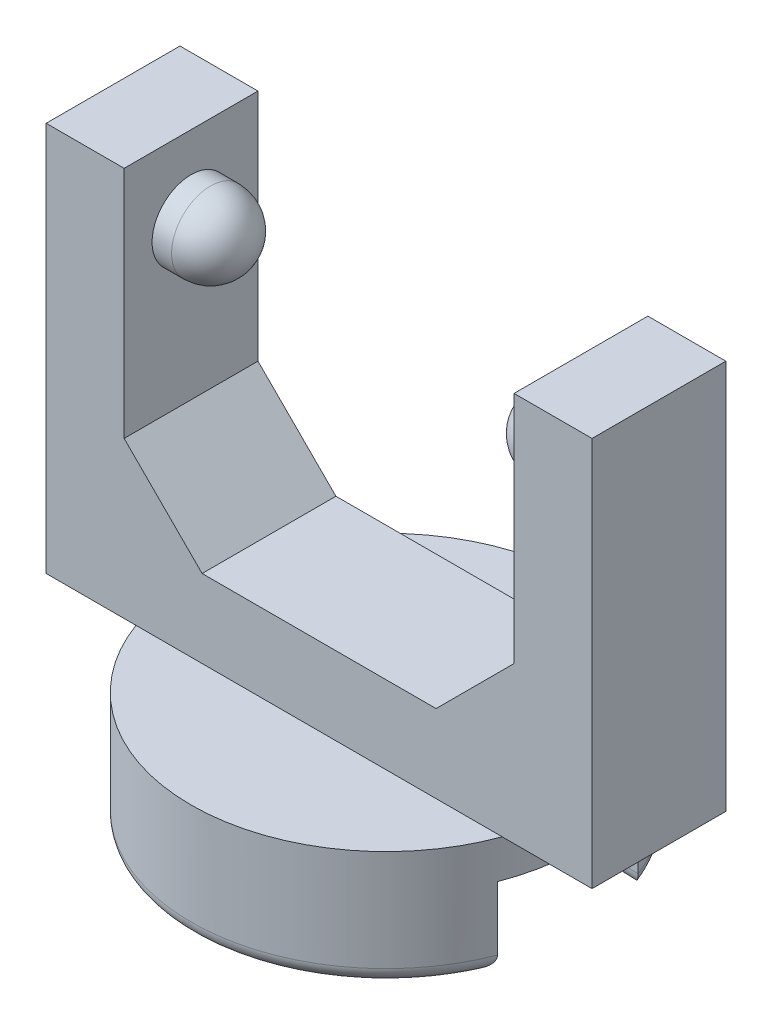
ISO-10303-21;
HEADER;
FILE_DESCRIPTION(('STEP AP214'),'2;1');
FILE_NAME('part.step','',(''),(''),'','','');
FILE_SCHEMA(('AUTOMOTIVE_DESIGN { 1 0 10303 214 1 1 1 1 }'));
ENDSEC;
DATA;
#1=APPLICATION_CONTEXT('core data for automotive mechanical design processes');
#2=APPLICATION_PROTOCOL_DEFINITION('international standard','automotive_design',2000,#1);
#3=PRODUCT_CONTEXT('',#1,'mechanical');
#4=PRODUCT('Part','Part','',(#3));
#5=PRODUCT_RELATED_PRODUCT_CATEGORY('part','',(#4));
#6=PRODUCT_DEFINITION_FORMATION('','',#4);
#7=PRODUCT_DEFINITION_CONTEXT('part definition',#1,'design');
#8=PRODUCT_DEFINITION('design','',#6,#7);
#9=PRODUCT_DEFINITION_SHAPE('','',#8);
#10=(LENGTH_UNIT() NAMED_UNIT(*) SI_UNIT(.MILLI.,.METRE.));
#11=(NAMED_UNIT(*) PLANE_ANGLE_UNIT() SI_UNIT($,.RADIAN.));
#12=(NAMED_UNIT(*) SI_UNIT($,.STERADIAN.) SOLID_ANGLE_UNIT());
#13=UNCERTAINTY_MEASURE_WITH_UNIT(LENGTH_MEASURE(1.E-05),#10,'distance_accuracy_value','');
#14=(GEOMETRIC_REPRESENTATION_CONTEXT(3) GLOBAL_UNCERTAINTY_ASSIGNED_CONTEXT((#13)) GLOBAL_UNIT_ASSIGNED_CONTEXT((#10,
#11,#12)) REPRESENTATION_CONTEXT('',''));
#15=CARTESIAN_POINT('',(0.,0.,0.));
#16=DIRECTION('',(0.,0.,1.));
#17=DIRECTION('',(1.,0.,0.));
#18=AXIS2_PLACEMENT_3D('',#15,#16,#17);
#19=CARTESIAN_POINT('',(0.,7.5,0.));
#20=DIRECTION('',(0.,-1.,0.));
#21=DIRECTION('',(0.,0.,-1.));
#22=AXIS2_PLACEMENT_3D('',#19,#20,#21);
#23=CYLINDRICAL_SURFACE('',#22,12.5);
#24=CARTESIAN_POINT('',(0.,7.5,0.));
#25=DIRECTION('',(0.,1.,0.));
#26=DIRECTION('',(0.,0.,1.));
#27=AXIS2_PLACEMENT_3D('',#24,#25,#26);
#28=CIRCLE('',#27,12.5);
#29=CARTESIAN_POINT('',(11.7406390583043,7.5,4.29038395748194));
#30=VERTEX_POINT('',#29);
#31=CARTESIAN_POINT('',(11.7406390583044,7.5,-4.29038395748194));
#32=VERTEX_POINT('',#31);
#33=EDGE_CURVE('E353',#30,#32,#28,.T.);
#34=ORIENTED_EDGE('',*,*,#33,.F.);
#35=CARTESIAN_POINT('',(-11.7406390583044,7.5,4.29038395748193));
#36=VERTEX_POINT('',#35);
#37=EDGE_CURVE('E352',#36,#30,#28,.T.);
#38=ORIENTED_EDGE('',*,*,#37,.F.);
#39=CARTESIAN_POINT('',(-11.7406390583044,7.5,-4.29038395748194));
#40=VERTEX_POINT('',#39);
#41=EDGE_CURVE('E653',#40,#36,#28,.T.);
#42=ORIENTED_EDGE('',*,*,#41,.F.);
#43=EDGE_CURVE('E357',#32,#40,#28,.T.);
#44=ORIENTED_EDGE('',*,*,#43,.F.);
#45=EDGE_LOOP('',(#34,#38,#42,#44));
#46=FACE_BOUND('',#45,.T.);
#47=DIRECTION('',(0.,-1.,0.));
#48=VECTOR('',#47,1.);
#49=CARTESIAN_POINT('',(11.6578277529164,5.08,-4.51054897804388));
#50=LINE('',#49,#48);
#51=CARTESIAN_POINT('',(11.6578277529164,5.08,-4.51054897804388));
#52=VERTEX_POINT('',#51);
#53=CARTESIAN_POINT('',(11.6578277529164,1.,-4.51054897804388));
#54=VERTEX_POINT('',#53);
#55=EDGE_CURVE('E254',#52,#54,#50,.T.);
#56=ORIENTED_EDGE('',*,*,#55,.T.);
#57=CARTESIAN_POINT('',(0.,1.,0.));
#58=DIRECTION('',(0.,1.,0.));
#59=DIRECTION('',(0.,0.,1.));
#60=AXIS2_PLACEMENT_3D('',#57,#58,#59);
#61=CIRCLE('',#60,12.5);
#62=CARTESIAN_POINT('',(11.6578277529163,1.,4.510548978044));
#63=VERTEX_POINT('',#62);
#64=EDGE_CURVE('E48',#54,#63,#61,.T.);
#65=ORIENTED_EDGE('',*,*,#64,.T.);
#66=DIRECTION('',(0.,-1.,0.));
#67=VECTOR('',#66,1.);
#68=CARTESIAN_POINT('',(11.6578277529163,5.08,4.510548978044));
#69=LINE('',#68,#67);
#70=CARTESIAN_POINT('',(11.6578277529163,5.08,4.510548978044));
#71=VERTEX_POINT('',#70);
#72=EDGE_CURVE('E250',#71,#63,#69,.T.);
#73=ORIENTED_EDGE('',*,*,#72,.F.);
#74=CARTESIAN_POINT('',(0.,5.08,0.));
#75=DIRECTION('',(0.,-1.,0.));
#76=DIRECTION('',(0.,0.,-1.));
#77=AXIS2_PLACEMENT_3D('',#74,#75,#76);
#78=CIRCLE('',#77,12.5);
#79=EDGE_CURVE('E223',#52,#71,#78,.T.);
#80=ORIENTED_EDGE('',*,*,#79,.F.);
#81=EDGE_LOOP('',(#56,#65,#73,#80));
#82=FACE_BOUND('',#81,.T.);
#83=ADVANCED_FACE('F38',(#46,#82),#23,.T.);
#84=CARTESIAN_POINT('',(0.,0.,0.));
#85=DIRECTION('',(0.,1.,0.));
#86=DIRECTION('',(0.,0.,1.));
#87=AXIS2_PLACEMENT_3D('',#84,#85,#86);
#88=PLANE('',#87);
#89=DIRECTION('',(0.866025403784439,0.,0.5));
#90=VECTOR('',#89,1.);
#91=CARTESIAN_POINT('',(-0.686525244046594,0.,9.95929214352111));
#92=LINE('',#91,#90);
#93=CARTESIAN_POINT('',(-9.12402524404657,0.,5.08789924723365));
#94=VERTEX_POINT('',#93);
#95=CARTESIAN_POINT('',(-0.186525244046594,0.,10.2479672781159));
#96=VERTEX_POINT('',#95);
#97=EDGE_CURVE('E419',#94,#96,#92,.T.);
#98=ORIENTED_EDGE('',*,*,#97,.T.);
#99=DIRECTION('',(0.866025403784439,0.,-0.5));
#100=VECTOR('',#99,1.);
#101=CARTESIAN_POINT('',(8.25097475595342,0.,5.37657438182844));
#102=LINE('',#101,#100);
#103=CARTESIAN_POINT('',(8.01892394838455,0.,5.510548978044));
#104=VERTEX_POINT('',#103);
#105=EDGE_CURVE('E422',#96,#104,#102,.T.);
#106=ORIENTED_EDGE('',*,*,#105,.T.);
#107=DIRECTION('',(1.,0.,0.));
#108=VECTOR('',#107,1.);
#109=CARTESIAN_POINT('',(11.6578277529163,0.,5.510548978044));
#110=LINE('',#109,#108);
#111=CARTESIAN_POINT('',(10.0937530166226,0.,5.510548978044));
#112=VERTEX_POINT('',#111);
#113=EDGE_CURVE('E401',#104,#112,#110,.T.);
#114=ORIENTED_EDGE('',*,*,#113,.T.);
#115=CARTESIAN_POINT('',(0.,0.,0.));
#116=DIRECTION('',(0.,1.,0.));
#117=DIRECTION('',(0.,0.,1.));
#118=AXIS2_PLACEMENT_3D('',#115,#116,#117);
#119=CIRCLE('',#118,11.5);
#120=CARTESIAN_POINT('',(10.0609424852993,0.,-5.57022767106509));
#121=VERTEX_POINT('',#120);
#122=EDGE_CURVE('E404',#112,#121,#119,.F.);
#123=ORIENTED_EDGE('',*,*,#122,.T.);
#124=DIRECTION('',(-0.999318241872767,0.,-0.036919526816074));
#125=VECTOR('',#124,1.);
#126=CARTESIAN_POINT('',(7.7878942827695,0.,-5.65420478721405));
#127=LINE('',#126,#125);
#128=CARTESIAN_POINT('',(8.03597981134498,0.,-5.64503933826982));
#129=VERTEX_POINT('',#128);
#130=EDGE_CURVE('E407',#121,#129,#127,.T.);
#131=ORIENTED_EDGE('',*,*,#130,.T.);
#132=DIRECTION('',(-0.866025403784439,0.,-0.5));
#133=VECTOR('',#132,1.);
#134=CARTESIAN_POINT('',(0.313474755953443,0.,-10.1036297108184));
#135=LINE('',#134,#133);
#136=CARTESIAN_POINT('',(-0.186525244046554,0.,-10.3923048454132));
#137=VERTEX_POINT('',#136);
#138=EDGE_CURVE('E410',#129,#137,#135,.T.);
#139=ORIENTED_EDGE('',*,*,#138,.T.);
#140=DIRECTION('',(-0.866025403784439,0.,0.5));
#141=VECTOR('',#140,1.);
#142=CARTESIAN_POINT('',(-8.62402524404657,0.,-5.52091194912571));
#143=LINE('',#142,#141);
#144=CARTESIAN_POINT('',(-9.12402524404657,0.,-5.23223681453089));
#145=VERTEX_POINT('',#144);
#146=EDGE_CURVE('E413',#137,#145,#143,.T.);
#147=ORIENTED_EDGE('',*,*,#146,.T.);
#148=DIRECTION('',(0.,0.,1.));
#149=VECTOR('',#148,1.);
#150=CARTESIAN_POINT('',(-9.12402524404657,0.,4.51054897804403));
#151=LINE('',#150,#149);
#152=EDGE_CURVE('E416',#145,#94,#151,.T.);
#153=ORIENTED_EDGE('',*,*,#152,.T.);
#154=EDGE_LOOP('',(#98,#106,#114,#123,#131,#139,#147,#153));
#155=FACE_BOUND('',#154,.T.);
#156=ADVANCED_FACE('F499',(#155),#88,.F.);
#157=CARTESIAN_POINT('',(0.,32.5,0.));
#158=DIRECTION('',(0.,1.,0.));
#159=DIRECTION('',(0.,0.,1.));
#160=AXIS2_PLACEMENT_3D('',#157,#158,#159);
#161=PLANE('',#160);
#162=DIRECTION('',(0.,0.,1.));
#163=VECTOR('',#162,1.);
#164=CARTESIAN_POINT('',(-12.5,32.5,-4.29038395748194));
#165=LINE('',#164,#163);
#166=CARTESIAN_POINT('',(-12.5,32.5,-4.29038395748194));
#167=VERTEX_POINT('',#166);
#168=CARTESIAN_POINT('',(-12.5,32.5,4.29038395748193));
#169=VERTEX_POINT('',#168);
#170=EDGE_CURVE('E253',#167,#169,#165,.T.);
#171=ORIENTED_EDGE('',*,*,#170,.F.);
#172=DIRECTION('',(-1.,0.,0.));
#173=VECTOR('',#172,1.);
#174=CARTESIAN_POINT('',(-17.5,32.5,-4.29038395748194));
#175=LINE('',#174,#173);
#176=CARTESIAN_POINT('',(-17.5,32.5,-4.29038395748194));
#177=VERTEX_POINT('',#176);
#178=EDGE_CURVE('E314',#167,#177,#175,.T.);
#179=ORIENTED_EDGE('',*,*,#178,.T.);
#180=DIRECTION('',(0.,0.,1.));
#181=VECTOR('',#180,1.);
#182=CARTESIAN_POINT('',(-17.5,32.5,-4.29038395748194));
#183=LINE('',#182,#181);
#184=CARTESIAN_POINT('',(-17.5,32.5,4.29038395748193));
#185=VERTEX_POINT('',#184);
#186=EDGE_CURVE('E301',#177,#185,#183,.T.);
#187=ORIENTED_EDGE('',*,*,#186,.T.);
#188=DIRECTION('',(1.,0.,0.));
#189=VECTOR('',#188,1.);
#190=CARTESIAN_POINT('',(-17.5,32.5,4.29038395748193));
#191=LINE('',#190,#189);
#192=EDGE_CURVE('E307',#185,#169,#191,.T.);
#193=ORIENTED_EDGE('',*,*,#192,.T.);
#194=EDGE_LOOP('',(#171,#179,#187,#193));
#195=FACE_BOUND('',#194,.T.);
#196=ADVANCED_FACE('F506',(#195),#161,.T.);
#197=CARTESIAN_POINT('',(0.,7.5,0.));
#198=DIRECTION('',(0.,1.,0.));
#199=DIRECTION('',(0.,0.,1.));
#200=AXIS2_PLACEMENT_3D('',#197,#198,#199);
#201=PLANE('',#200);
#202=DIRECTION('',(-1.,0.,0.));
#203=VECTOR('',#202,1.);
#204=CARTESIAN_POINT('',(-17.5,7.5,-4.29038395748194));
#205=LINE('',#204,#203);
#206=EDGE_CURVE('E336',#32,#40,#205,.T.);
#207=ORIENTED_EDGE('',*,*,#206,.F.);
#208=ORIENTED_EDGE('',*,*,#43,.T.);
#209=EDGE_LOOP('',(#207,#208));
#210=FACE_BOUND('',#209,.T.);
#211=ADVANCED_FACE('F640',(#210),#201,.T.);
#212=DIRECTION('',(1.,0.,0.));
#213=VECTOR('',#212,1.);
#214=CARTESIAN_POINT('',(-17.5,7.5,4.29038395748193));
#215=LINE('',#214,#213);
#216=EDGE_CURVE('E329',#36,#30,#215,.T.);
#217=ORIENTED_EDGE('',*,*,#216,.F.);
#218=ORIENTED_EDGE('',*,*,#37,.T.);
#219=EDGE_LOOP('',(#217,#218));
#220=FACE_BOUND('',#219,.T.);
#221=ADVANCED_FACE('F623',(#220),#201,.T.);
#222=CARTESIAN_POINT('',(0.,7.5,0.));
#223=DIRECTION('',(0.,1.,0.));
#224=DIRECTION('',(0.,0.,1.));
#225=AXIS2_PLACEMENT_3D('',#222,#223,#224);
#226=PLANE('',#225);
#227=CARTESIAN_POINT('',(17.5,7.5,4.29038395748194));
#228=VERTEX_POINT('',#227);
#229=EDGE_CURVE('E323',#30,#228,#215,.T.);
#230=ORIENTED_EDGE('',*,*,#229,.F.);
#231=ORIENTED_EDGE('',*,*,#33,.T.);
#232=CARTESIAN_POINT('',(17.5,7.5,-4.29038395748194));
#233=VERTEX_POINT('',#232);
#234=EDGE_CURVE('E306',#233,#32,#205,.T.);
#235=ORIENTED_EDGE('',*,*,#234,.F.);
#236=DIRECTION('',(0.,0.,-1.));
#237=VECTOR('',#236,1.);
#238=CARTESIAN_POINT('',(17.5,7.5,-4.29038395748194));
#239=LINE('',#238,#237);
#240=EDGE_CURVE('E328',#228,#233,#239,.T.);
#241=ORIENTED_EDGE('',*,*,#240,.F.);
#242=EDGE_LOOP('',(#230,#231,#235,#241));
#243=FACE_BOUND('',#242,.T.);
#244=ADVANCED_FACE('F619',(#243),#226,.F.);
#245=CARTESIAN_POINT('',(-17.5,7.5,-4.29038395748194));
#246=VERTEX_POINT('',#245);
#247=EDGE_CURVE('E332',#40,#246,#205,.T.);
#248=ORIENTED_EDGE('',*,*,#247,.F.);
#249=ORIENTED_EDGE('',*,*,#41,.T.);
#250=CARTESIAN_POINT('',(-17.5,7.5,4.29038395748193));
#251=VERTEX_POINT('',#250);
#252=EDGE_CURVE('E324',#251,#36,#215,.T.);
#253=ORIENTED_EDGE('',*,*,#252,.F.);
#254=DIRECTION('',(0.,0.,1.));
#255=VECTOR('',#254,1.);
#256=CARTESIAN_POINT('',(-17.5,7.5,-4.29038395748194));
#257=LINE('',#256,#255);
#258=EDGE_CURVE('E292',#246,#251,#257,.T.);
#259=ORIENTED_EDGE('',*,*,#258,.F.);
#260=EDGE_LOOP('',(#248,#249,#253,#259));
#261=FACE_BOUND('',#260,.T.);
#262=ADVANCED_FACE('F622',(#261),#226,.F.);
#263=CARTESIAN_POINT('',(-17.5,32.5,-4.29038395748194));
#264=DIRECTION('',(1.,0.,0.));
#265=DIRECTION('',(0.,0.,-1.));
#266=AXIS2_PLACEMENT_3D('',#263,#264,#265);
#267=PLANE('',#266);
#268=ORIENTED_EDGE('',*,*,#258,.T.);
#269=DIRECTION('',(0.,-1.,0.));
#270=VECTOR('',#269,1.);
#271=CARTESIAN_POINT('',(-17.5,32.5,4.29038395748193));
#272=LINE('',#271,#270);
#273=EDGE_CURVE('E348',#185,#251,#272,.T.);
#274=ORIENTED_EDGE('',*,*,#273,.F.);
#275=ORIENTED_EDGE('',*,*,#186,.F.);
#276=DIRECTION('',(0.,-1.,0.));
#277=VECTOR('',#276,1.);
#278=CARTESIAN_POINT('',(-17.5,32.5,-4.29038395748194));
#279=LINE('',#278,#277);
#280=EDGE_CURVE('E319',#177,#246,#279,.T.);
#281=ORIENTED_EDGE('',*,*,#280,.T.);
#282=EDGE_LOOP('',(#268,#274,#275,#281));
#283=FACE_BOUND('',#282,.T.);
#284=ADVANCED_FACE('F635',(#283),#267,.F.);
#285=CARTESIAN_POINT('',(-17.5,32.5,4.29038395748193));
#286=DIRECTION('',(0.,0.,-1.));
#287=DIRECTION('',(-1.,0.,0.));
#288=AXIS2_PLACEMENT_3D('',#285,#286,#287);
#289=PLANE('',#288);
#290=DIRECTION('',(1.,0.,0.));
#291=VECTOR('',#290,1.);
#292=CARTESIAN_POINT('',(-12.5,12.5,4.29038395748193));
#293=LINE('',#292,#291);
#294=CARTESIAN_POINT('',(-7.49999999999997,12.5,4.29038395748193));
#295=VERTEX_POINT('',#294);
#296=CARTESIAN_POINT('',(7.49999999999997,12.5,4.29038395748193));
#297=VERTEX_POINT('',#296);
#298=EDGE_CURVE('E274',#295,#297,#293,.T.);
#299=ORIENTED_EDGE('',*,*,#298,.F.);
#300=DIRECTION('',(-0.707106781186551,0.707106781186544,0.));
#301=VECTOR('',#300,1.);
#302=CARTESIAN_POINT('',(-22.5,27.4999999999999,4.29038395748193));
#303=LINE('',#302,#301);
#304=CARTESIAN_POINT('',(-12.5,17.5,4.29038395748193));
#305=VERTEX_POINT('',#304);
#306=EDGE_CURVE('E381',#295,#305,#303,.T.);
#307=ORIENTED_EDGE('',*,*,#306,.T.);
#308=DIRECTION('',(0.,1.,0.));
#309=VECTOR('',#308,1.);
#310=CARTESIAN_POINT('',(-12.5,12.5,4.29038395748193));
#311=LINE('',#310,#309);
#312=EDGE_CURVE('E282',#305,#169,#311,.T.);
#313=ORIENTED_EDGE('',*,*,#312,.T.);
#314=ORIENTED_EDGE('',*,*,#192,.F.);
#315=ORIENTED_EDGE('',*,*,#273,.T.);
#316=ORIENTED_EDGE('',*,*,#252,.T.);
#317=ORIENTED_EDGE('',*,*,#216,.T.);
#318=ORIENTED_EDGE('',*,*,#229,.T.);
#319=DIRECTION('',(0.,-1.,0.));
#320=VECTOR('',#319,1.);
#321=CARTESIAN_POINT('',(17.5,32.5,4.29038395748194));
#322=LINE('',#321,#320);
#323=CARTESIAN_POINT('',(17.5,32.5,4.29038395748194));
#324=VERTEX_POINT('',#323);
#325=EDGE_CURVE('E344',#324,#228,#322,.T.);
#326=ORIENTED_EDGE('',*,*,#325,.F.);
#327=CARTESIAN_POINT('',(12.5,32.5,4.29038395748194));
#328=VERTEX_POINT('',#327);
#329=EDGE_CURVE('E305',#328,#324,#191,.T.);
#330=ORIENTED_EDGE('',*,*,#329,.F.);
#331=DIRECTION('',(0.,1.,0.));
#332=VECTOR('',#331,1.);
#333=CARTESIAN_POINT('',(12.5,12.5,4.29038395748193));
#334=LINE('',#333,#332);
#335=CARTESIAN_POINT('',(12.5,17.5,4.29038395748193));
#336=VERTEX_POINT('',#335);
#337=EDGE_CURVE('E296',#336,#328,#334,.T.);
#338=ORIENTED_EDGE('',*,*,#337,.F.);
#339=DIRECTION('',(-0.707106781186551,-0.707106781186544,0.));
#340=VECTOR('',#339,1.);
#341=CARTESIAN_POINT('',(4.99999999999987,9.99999999999991,4.29038395748193));
#342=LINE('',#341,#340);
#343=EDGE_CURVE('E398',#336,#297,#342,.T.);
#344=ORIENTED_EDGE('',*,*,#343,.T.);
#345=EDGE_LOOP('',(#299,#307,#313,#314,#315,#316,#317,#318,#326,#330,#338,#344));
#346=FACE_BOUND('',#345,.T.);
#347=ADVANCED_FACE('F631',(#346),#289,.F.);
#348=CARTESIAN_POINT('',(17.5,32.5,-4.29038395748194));
#349=DIRECTION('',(-1.,0.,0.));
#350=DIRECTION('',(0.,0.,1.));
#351=AXIS2_PLACEMENT_3D('',#348,#349,#350);
#352=PLANE('',#351);
#353=ORIENTED_EDGE('',*,*,#240,.T.);
#354=DIRECTION('',(0.,-1.,0.));
#355=VECTOR('',#354,1.);
#356=CARTESIAN_POINT('',(17.5,32.5,-4.29038395748194));
#357=LINE('',#356,#355);
#358=CARTESIAN_POINT('',(17.5,32.5,-4.29038395748194));
#359=VERTEX_POINT('',#358);
#360=EDGE_CURVE('E340',#359,#233,#357,.T.);
#361=ORIENTED_EDGE('',*,*,#360,.F.);
#362=DIRECTION('',(0.,0.,-1.));
#363=VECTOR('',#362,1.);
#364=CARTESIAN_POINT('',(17.5,32.5,-4.29038395748194));
#365=LINE('',#364,#363);
#366=EDGE_CURVE('E311',#324,#359,#365,.T.);
#367=ORIENTED_EDGE('',*,*,#366,.F.);
#368=ORIENTED_EDGE('',*,*,#325,.T.);
#369=EDGE_LOOP('',(#353,#361,#367,#368));
#370=FACE_BOUND('',#369,.T.);
#371=ADVANCED_FACE('F627',(#370),#352,.F.);
#372=CARTESIAN_POINT('',(-17.5,32.5,-4.29038395748194));
#373=DIRECTION('',(0.,0.,1.));
#374=DIRECTION('',(1.,0.,0.));
#375=AXIS2_PLACEMENT_3D('',#372,#373,#374);
#376=PLANE('',#375);
#377=ORIENTED_EDGE('',*,*,#178,.F.);
#378=DIRECTION('',(0.,1.,0.));
#379=VECTOR('',#378,1.);
#380=CARTESIAN_POINT('',(-12.5,12.5,-4.29038395748194));
#381=LINE('',#380,#379);
#382=CARTESIAN_POINT('',(-12.5,17.5,-4.29038395748194));
#383=VERTEX_POINT('',#382);
#384=EDGE_CURVE('E289',#383,#167,#381,.T.);
#385=ORIENTED_EDGE('',*,*,#384,.F.);
#386=DIRECTION('',(0.707106781186551,-0.707106781186544,0.));
#387=VECTOR('',#386,1.);
#388=CARTESIAN_POINT('',(-22.5,27.4999999999999,-4.29038395748194));
#389=LINE('',#388,#387);
#390=CARTESIAN_POINT('',(-7.49999999999997,12.5,-4.29038395748194));
#391=VERTEX_POINT('',#390);
#392=EDGE_CURVE('E384',#383,#391,#389,.T.);
#393=ORIENTED_EDGE('',*,*,#392,.T.);
#394=DIRECTION('',(-1.,0.,0.));
#395=VECTOR('',#394,1.);
#396=CARTESIAN_POINT('',(-12.5,12.5,-4.29038395748194));
#397=LINE('',#396,#395);
#398=CARTESIAN_POINT('',(7.49999999999996,12.5,-4.29038395748194));
#399=VERTEX_POINT('',#398);
#400=EDGE_CURVE('E278',#399,#391,#397,.T.);
#401=ORIENTED_EDGE('',*,*,#400,.F.);
#402=DIRECTION('',(0.707106781186551,0.707106781186544,0.));
#403=VECTOR('',#402,1.);
#404=CARTESIAN_POINT('',(4.99999999999987,9.99999999999991,-4.29038395748194));
#405=LINE('',#404,#403);
#406=CARTESIAN_POINT('',(12.5,17.5,-4.29038395748194));
#407=VERTEX_POINT('',#406);
#408=EDGE_CURVE('E395',#399,#407,#405,.T.);
#409=ORIENTED_EDGE('',*,*,#408,.T.);
#410=DIRECTION('',(0.,1.,0.));
#411=VECTOR('',#410,1.);
#412=CARTESIAN_POINT('',(12.5,12.5,-4.29038395748194));
#413=LINE('',#412,#411);
#414=CARTESIAN_POINT('',(12.5,32.5,-4.29038395748194));
#415=VERTEX_POINT('',#414);
#416=EDGE_CURVE('E293',#407,#415,#413,.T.);
#417=ORIENTED_EDGE('',*,*,#416,.T.);
#418=EDGE_CURVE('E315',#359,#415,#175,.T.);
#419=ORIENTED_EDGE('',*,*,#418,.F.);
#420=ORIENTED_EDGE('',*,*,#360,.T.);
#421=ORIENTED_EDGE('',*,*,#234,.T.);
#422=ORIENTED_EDGE('',*,*,#206,.T.);
#423=ORIENTED_EDGE('',*,*,#247,.T.);
#424=ORIENTED_EDGE('',*,*,#280,.F.);
#425=EDGE_LOOP('',(#377,#385,#393,#401,#409,#417,#419,#420,#421,#422,#423,#424));
#426=FACE_BOUND('',#425,.T.);
#427=ADVANCED_FACE('F617',(#426),#376,.F.);
#428=DIRECTION('',(0.,0.,-1.));
#429=VECTOR('',#428,1.);
#430=CARTESIAN_POINT('',(12.5,32.5,-4.29038395748194));
#431=LINE('',#430,#429);
#432=EDGE_CURVE('E279',#328,#415,#431,.T.);
#433=ORIENTED_EDGE('',*,*,#432,.F.);
#434=ORIENTED_EDGE('',*,*,#329,.T.);
#435=ORIENTED_EDGE('',*,*,#366,.T.);
#436=ORIENTED_EDGE('',*,*,#418,.T.);
#437=EDGE_LOOP('',(#433,#434,#435,#436));
#438=FACE_BOUND('',#437,.T.);
#439=ADVANCED_FACE('F613',(#438),#161,.T.);
#440=CARTESIAN_POINT('',(-12.5,12.5,-4.29038395748194));
#441=DIRECTION('',(-1.,0.,0.));
#442=DIRECTION('',(0.,0.,1.));
#443=AXIS2_PLACEMENT_3D('',#440,#441,#442);
#444=PLANE('',#443);
#445=CARTESIAN_POINT('',(-12.5,27.5,0.));
#446=DIRECTION('',(-1.,0.,0.));
#447=DIRECTION('',(0.,0.,1.));
#448=AXIS2_PLACEMENT_3D('',#445,#446,#447);
#449=CIRCLE('',#448,2.5);
#450=CARTESIAN_POINT('',(-12.5,27.5,2.5));
#451=VERTEX_POINT('',#450);
#452=EDGE_CURVE('E358',#451,#451,#449,.F.);
#453=ORIENTED_EDGE('',*,*,#452,.F.);
#454=EDGE_LOOP('',(#453));
#455=FACE_BOUND('',#454,.T.);
#456=ORIENTED_EDGE('',*,*,#312,.F.);
#457=DIRECTION('',(0.,0.,-1.));
#458=VECTOR('',#457,1.);
#459=CARTESIAN_POINT('',(-12.5,17.5,-4.29038395748194));
#460=LINE('',#459,#458);
#461=EDGE_CURVE('E378',#305,#383,#460,.T.);
#462=ORIENTED_EDGE('',*,*,#461,.T.);
#463=ORIENTED_EDGE('',*,*,#384,.T.);
#464=ORIENTED_EDGE('',*,*,#170,.T.);
#465=EDGE_LOOP('',(#456,#462,#463,#464));
#466=FACE_BOUND('',#465,.T.);
#467=ADVANCED_FACE('F609',(#455,#466),#444,.F.);
#468=CARTESIAN_POINT('',(12.5,12.5,-4.29038395748194));
#469=DIRECTION('',(1.,0.,0.));
#470=DIRECTION('',(0.,0.,-1.));
#471=AXIS2_PLACEMENT_3D('',#468,#469,#470);
#472=PLANE('',#471);
#473=CARTESIAN_POINT('',(12.5,27.5,0.));
#474=DIRECTION('',(1.,0.,0.));
#475=DIRECTION('',(0.,0.,-1.));
#476=AXIS2_PLACEMENT_3D('',#473,#474,#475);
#477=CIRCLE('',#476,2.5);
#478=CARTESIAN_POINT('',(12.5,27.5,-2.49999999999999));
#479=VERTEX_POINT('',#478);
#480=EDGE_CURVE('E362',#479,#479,#477,.F.);
#481=ORIENTED_EDGE('',*,*,#480,.F.);
#482=EDGE_LOOP('',(#481));
#483=FACE_BOUND('',#482,.T.);
#484=ORIENTED_EDGE('',*,*,#416,.F.);
#485=DIRECTION('',(0.,0.,1.));
#486=VECTOR('',#485,1.);
#487=CARTESIAN_POINT('',(12.5,17.5,-4.29038395748194));
#488=LINE('',#487,#486);
#489=EDGE_CURVE('E392',#407,#336,#488,.T.);
#490=ORIENTED_EDGE('',*,*,#489,.T.);
#491=ORIENTED_EDGE('',*,*,#337,.T.);
#492=ORIENTED_EDGE('',*,*,#432,.T.);
#493=EDGE_LOOP('',(#484,#490,#491,#492));
#494=FACE_BOUND('',#493,.T.);
#495=ADVANCED_FACE('F605',(#483,#494),#472,.F.);
#496=CARTESIAN_POINT('',(0.,12.5,0.));
#497=DIRECTION('',(0.,1.,0.));
#498=DIRECTION('',(0.,0.,1.));
#499=AXIS2_PLACEMENT_3D('',#496,#497,#498);
#500=PLANE('',#499);
#501=ORIENTED_EDGE('',*,*,#298,.T.);
#502=DIRECTION('',(0.,0.,-1.));
#503=VECTOR('',#502,1.);
#504=CARTESIAN_POINT('',(7.49999999999997,12.5,0.));
#505=LINE('',#504,#503);
#506=EDGE_CURVE('E388',#297,#399,#505,.T.);
#507=ORIENTED_EDGE('',*,*,#506,.T.);
#508=ORIENTED_EDGE('',*,*,#400,.T.);
#509=DIRECTION('',(0.,0.,1.));
#510=VECTOR('',#509,1.);
#511=CARTESIAN_POINT('',(-7.49999999999997,12.5,0.));
#512=LINE('',#511,#510);
#513=EDGE_CURVE('E374',#391,#295,#512,.T.);
#514=ORIENTED_EDGE('',*,*,#513,.T.);
#515=EDGE_LOOP('',(#501,#507,#508,#514));
#516=FACE_BOUND('',#515,.T.);
#517=ADVANCED_FACE('F601',(#516),#500,.T.);
#518=CARTESIAN_POINT('',(-8.75,27.5,0.));
#519=DIRECTION('',(-1.,0.,0.));
#520=DIRECTION('',(0.,0.,1.));
#521=AXIS2_PLACEMENT_3D('',#518,#519,#520);
#522=CYLINDRICAL_SURFACE('',#521,2.5);
#523=CARTESIAN_POINT('',(-11.25,27.5,0.));
#524=DIRECTION('',(-1.,0.,0.));
#525=DIRECTION('',(0.,0.,1.));
#526=AXIS2_PLACEMENT_3D('',#523,#524,#525);
#527=CIRCLE('',#526,2.5);
#528=CARTESIAN_POINT('',(-11.25,27.5,2.5));
#529=VERTEX_POINT('',#528);
#530=EDGE_CURVE('E366',#529,#529,#527,.T.);
#531=ORIENTED_EDGE('',*,*,#530,.T.);
#532=EDGE_LOOP('',(#531));
#533=FACE_BOUND('',#532,.T.);
#534=ORIENTED_EDGE('',*,*,#452,.T.);
#535=EDGE_LOOP('',(#534));
#536=FACE_BOUND('',#535,.T.);
#537=ADVANCED_FACE('F597',(#533,#536),#522,.T.);
#538=CARTESIAN_POINT('',(8.75,27.5,0.));
#539=DIRECTION('',(1.,0.,0.));
#540=DIRECTION('',(0.,0.,-1.));
#541=AXIS2_PLACEMENT_3D('',#538,#539,#540);
#542=CYLINDRICAL_SURFACE('',#541,2.5);
#543=CARTESIAN_POINT('',(11.25,27.5,0.));
#544=DIRECTION('',(1.,0.,0.));
#545=DIRECTION('',(0.,0.,-1.));
#546=AXIS2_PLACEMENT_3D('',#543,#544,#545);
#547=CIRCLE('',#546,2.5);
#548=CARTESIAN_POINT('',(11.25,27.5,-2.5));
#549=VERTEX_POINT('',#548);
#550=EDGE_CURVE('E370',#549,#549,#547,.T.);
#551=ORIENTED_EDGE('',*,*,#550,.T.);
#552=EDGE_LOOP('',(#551));
#553=FACE_BOUND('',#552,.T.);
#554=ORIENTED_EDGE('',*,*,#480,.T.);
#555=EDGE_LOOP('',(#554));
#556=FACE_BOUND('',#555,.T.);
#557=ADVANCED_FACE('F515',(#553,#556),#542,.T.);
#558=CARTESIAN_POINT('',(-11.25,27.5,0.));
#559=DIRECTION('',(1.,0.,0.));
#560=DIRECTION('',(0.,0.,-1.));
#561=AXIS2_PLACEMENT_3D('',#558,#559,#560);
#562=SPHERICAL_SURFACE('',#561,2.5);
#563=ORIENTED_EDGE('',*,*,#530,.F.);
#564=EDGE_LOOP('',(#563));
#565=FACE_BOUND('',#564,.T.);
#566=ADVANCED_FACE('F511',(#565),#562,.T.);
#567=CARTESIAN_POINT('',(11.25,27.5,0.));
#568=DIRECTION('',(-1.,0.,0.));
#569=DIRECTION('',(0.,0.,1.));
#570=AXIS2_PLACEMENT_3D('',#567,#568,#569);
#571=SPHERICAL_SURFACE('',#570,2.5);
#572=ORIENTED_EDGE('',*,*,#550,.F.);
#573=EDGE_LOOP('',(#572));
#574=FACE_BOUND('',#573,.T.);
#575=ADVANCED_FACE('F514',(#574),#571,.T.);
#576=CARTESIAN_POINT('',(-7.49999999999997,12.5,0.));
#577=DIRECTION('',(-0.707106781186544,-0.707106781186551,0.));
#578=DIRECTION('',(0.,0.,1.));
#579=AXIS2_PLACEMENT_3D('',#576,#577,#578);
#580=PLANE('',#579);
#581=ORIENTED_EDGE('',*,*,#392,.F.);
#582=ORIENTED_EDGE('',*,*,#461,.F.);
#583=ORIENTED_EDGE('',*,*,#306,.F.);
#584=ORIENTED_EDGE('',*,*,#513,.F.);
#585=EDGE_LOOP('',(#581,#582,#583,#584));
#586=FACE_BOUND('',#585,.T.);
#587=ADVANCED_FACE('F519',(#586),#580,.F.);
#588=CARTESIAN_POINT('',(7.49999999999997,12.5,0.));
#589=DIRECTION('',(0.707106781186544,-0.707106781186551,0.));
#590=DIRECTION('',(0.,0.,-1.));
#591=AXIS2_PLACEMENT_3D('',#588,#589,#590);
#592=PLANE('',#591);
#593=ORIENTED_EDGE('',*,*,#343,.F.);
#594=ORIENTED_EDGE('',*,*,#489,.F.);
#595=ORIENTED_EDGE('',*,*,#408,.F.);
#596=ORIENTED_EDGE('',*,*,#506,.F.);
#597=EDGE_LOOP('',(#593,#594,#595,#596));
#598=FACE_BOUND('',#597,.T.);
#599=ADVANCED_FACE('F523',(#598),#592,.F.);
#600=CARTESIAN_POINT('',(0.,5.08,4.510548978044));
#601=DIRECTION('',(0.,0.,-1.));
#602=DIRECTION('',(-1.,0.,0.));
#603=AXIS2_PLACEMENT_3D('',#600,#601,#602);
#604=PLANE('',#603);
#605=ORIENTED_EDGE('',*,*,#72,.T.);
#606=DIRECTION('',(1.,0.,0.));
#607=VECTOR('',#606,1.);
#608=CARTESIAN_POINT('',(7.75097475595342,1.,4.510548978044));
#609=LINE('',#608,#607);
#610=CARTESIAN_POINT('',(7.75097475595342,1.,4.510548978044));
#611=VERTEX_POINT('',#610);
#612=EDGE_CURVE('E11',#63,#611,#609,.F.);
#613=ORIENTED_EDGE('',*,*,#612,.T.);
#614=DIRECTION('',(0.,-1.,0.));
#615=VECTOR('',#614,1.);
#616=CARTESIAN_POINT('',(7.75097475595342,5.08,4.510548978044));
#617=LINE('',#616,#615);
#618=CARTESIAN_POINT('',(7.75097475595342,5.08,4.510548978044));
#619=VERTEX_POINT('',#618);
#620=EDGE_CURVE('E207',#619,#611,#617,.T.);
#621=ORIENTED_EDGE('',*,*,#620,.F.);
#622=DIRECTION('',(1.,0.,0.));
#623=VECTOR('',#622,1.);
#624=CARTESIAN_POINT('',(0.,5.08,4.510548978044));
#625=LINE('',#624,#623);
#626=EDGE_CURVE('E216',#619,#71,#625,.T.);
#627=ORIENTED_EDGE('',*,*,#626,.T.);
#628=EDGE_LOOP('',(#605,#613,#621,#627));
#629=FACE_BOUND('',#628,.T.);
#630=ADVANCED_FACE('F219',(#629),#604,.T.);
#631=CARTESIAN_POINT('',(0.182304021729584,5.08,-4.93450892230355));
#632=DIRECTION('',(-0.036919526816074,0.,0.999318241872767));
#633=DIRECTION('',(0.999318241872767,0.,0.036919526816074));
#634=AXIS2_PLACEMENT_3D('',#631,#632,#633);
#635=PLANE('',#634);
#636=DIRECTION('',(0.,-1.,0.));
#637=VECTOR('',#636,1.);
#638=CARTESIAN_POINT('',(7.75097475595342,5.08,-4.65488654534129));
#639=LINE('',#638,#637);
#640=CARTESIAN_POINT('',(7.75097475595342,5.08,-4.65488654534129));
#641=VERTEX_POINT('',#640);
#642=CARTESIAN_POINT('',(7.75097475595342,1.,-4.65488654534129));
#643=VERTEX_POINT('',#642);
#644=EDGE_CURVE('E257',#641,#643,#639,.T.);
#645=ORIENTED_EDGE('',*,*,#644,.T.);
#646=DIRECTION('',(-0.999318241872767,0.,-0.036919526816074));
#647=VECTOR('',#646,1.);
#648=CARTESIAN_POINT('',(11.6578277529164,1.,-4.51054897804388));
#649=LINE('',#648,#647);
#650=EDGE_CURVE('E63',#643,#54,#649,.F.);
#651=ORIENTED_EDGE('',*,*,#650,.T.);
#652=ORIENTED_EDGE('',*,*,#55,.F.);
#653=DIRECTION('',(-0.999318241872767,0.,-0.036919526816074));
#654=VECTOR('',#653,1.);
#655=CARTESIAN_POINT('',(0.182304021729584,5.08,-4.93450892230355));
#656=LINE('',#655,#654);
#657=EDGE_CURVE('E245',#52,#641,#656,.T.);
#658=ORIENTED_EDGE('',*,*,#657,.T.);
#659=EDGE_LOOP('',(#645,#651,#652,#658));
#660=FACE_BOUND('',#659,.T.);
#661=ADVANCED_FACE('F576',(#660),#635,.T.);
#662=CARTESIAN_POINT('',(3.95336868898833,5.08,-6.84743543037974));
#663=DIRECTION('',(-0.5,0.,0.866025403784439));
#664=DIRECTION('',(0.866025403784439,0.,0.5));
#665=AXIS2_PLACEMENT_3D('',#662,#663,#664);
#666=PLANE('',#665);
#667=DIRECTION('',(0.,-1.,0.));
#668=VECTOR('',#667,1.);
#669=CARTESIAN_POINT('',(-0.186525244046555,5.08,-9.23760430703393));
#670=LINE('',#669,#668);
#671=CARTESIAN_POINT('',(-0.186525244046555,5.08,-9.23760430703393));
#672=VERTEX_POINT('',#671);
#673=CARTESIAN_POINT('',(-0.186525244046555,1.,-9.23760430703393));
#674=VERTEX_POINT('',#673);
#675=EDGE_CURVE('E260',#672,#674,#670,.T.);
#676=ORIENTED_EDGE('',*,*,#675,.T.);
#677=DIRECTION('',(-0.866025403784439,0.,-0.5));
#678=VECTOR('',#677,1.);
#679=CARTESIAN_POINT('',(7.75097475595343,1.,-4.65488654534129));
#680=LINE('',#679,#678);
#681=EDGE_CURVE('E438',#674,#643,#680,.F.);
#682=ORIENTED_EDGE('',*,*,#681,.T.);
#683=ORIENTED_EDGE('',*,*,#644,.F.);
#684=DIRECTION('',(-0.866025403784439,0.,-0.5));
#685=VECTOR('',#684,1.);
#686=CARTESIAN_POINT('',(3.95336868898833,5.08,-6.84743543037974));
#687=LINE('',#686,#685);
#688=EDGE_CURVE('E242',#641,#672,#687,.T.);
#689=ORIENTED_EDGE('',*,*,#688,.T.);
#690=EDGE_LOOP('',(#676,#682,#683,#689));
#691=FACE_BOUND('',#690,.T.);
#692=ADVANCED_FACE('F575',(#691),#666,.T.);
#693=CARTESIAN_POINT('',(-4.0466313110116,5.08,-7.00897103017115));
#694=DIRECTION('',(0.5,0.,0.866025403784439));
#695=DIRECTION('',(0.866025403784439,0.,-0.5));
#696=AXIS2_PLACEMENT_3D('',#693,#694,#695);
#697=PLANE('',#696);
#698=DIRECTION('',(0.,-1.,0.));
#699=VECTOR('',#698,1.);
#700=CARTESIAN_POINT('',(-8.12402524404657,5.08,-4.65488654534126));
#701=LINE('',#700,#699);
#702=CARTESIAN_POINT('',(-8.12402524404657,5.08,-4.65488654534126));
#703=VERTEX_POINT('',#702);
#704=CARTESIAN_POINT('',(-8.12402524404657,1.,-4.65488654534126));
#705=VERTEX_POINT('',#704);
#706=EDGE_CURVE('E264',#703,#705,#701,.T.);
#707=ORIENTED_EDGE('',*,*,#706,.T.);
#708=DIRECTION('',(-0.866025403784439,0.,0.5));
#709=VECTOR('',#708,1.);
#710=CARTESIAN_POINT('',(-0.186525244046554,1.,-9.23760430703393));
#711=LINE('',#710,#709);
#712=EDGE_CURVE('E435',#705,#674,#711,.F.);
#713=ORIENTED_EDGE('',*,*,#712,.T.);
#714=ORIENTED_EDGE('',*,*,#675,.F.);
#715=DIRECTION('',(-0.866025403784439,0.,0.5));
#716=VECTOR('',#715,1.);
#717=CARTESIAN_POINT('',(-4.0466313110116,5.08,-7.00897103017115));
#718=LINE('',#717,#716);
#719=EDGE_CURVE('E239',#672,#703,#718,.T.);
#720=ORIENTED_EDGE('',*,*,#719,.T.);
#721=EDGE_LOOP('',(#707,#713,#714,#720));
#722=FACE_BOUND('',#721,.T.);
#723=ADVANCED_FACE('F554',(#722),#697,.T.);
#724=CARTESIAN_POINT('',(-8.12402524404657,5.08,0.));
#725=DIRECTION('',(1.,0.,0.));
#726=DIRECTION('',(0.,0.,-1.));
#727=AXIS2_PLACEMENT_3D('',#724,#725,#726);
#728=PLANE('',#727);
#729=DIRECTION('',(0.,-1.,0.));
#730=VECTOR('',#729,1.);
#731=CARTESIAN_POINT('',(-8.12402524404657,5.08,4.51054897804403));
#732=LINE('',#731,#730);
#733=CARTESIAN_POINT('',(-8.12402524404657,5.08,4.51054897804403));
#734=VERTEX_POINT('',#733);
#735=CARTESIAN_POINT('',(-8.12402524404657,1.,4.51054897804403));
#736=VERTEX_POINT('',#735);
#737=EDGE_CURVE('E268',#734,#736,#732,.T.);
#738=ORIENTED_EDGE('',*,*,#737,.T.);
#739=DIRECTION('',(0.,0.,1.));
#740=VECTOR('',#739,1.);
#741=CARTESIAN_POINT('',(-8.12402524404657,1.,-4.65488654534126));
#742=LINE('',#741,#740);
#743=EDGE_CURVE('E432',#736,#705,#742,.F.);
#744=ORIENTED_EDGE('',*,*,#743,.T.);
#745=ORIENTED_EDGE('',*,*,#706,.F.);
#746=DIRECTION('',(0.,0.,1.));
#747=VECTOR('',#746,1.);
#748=CARTESIAN_POINT('',(-8.12402524404657,5.08,0.));
#749=LINE('',#748,#747);
#750=EDGE_CURVE('E236',#703,#734,#749,.T.);
#751=ORIENTED_EDGE('',*,*,#750,.T.);
#752=EDGE_LOOP('',(#738,#744,#745,#751));
#753=FACE_BOUND('',#752,.T.);
#754=ADVANCED_FACE('F550',(#753),#728,.T.);
#755=CARTESIAN_POINT('',(-3.98413131101168,5.08,6.90071785469822));
#756=DIRECTION('',(0.5,0.,-0.866025403784439));
#757=DIRECTION('',(-0.866025403784439,0.,-0.5));
#758=AXIS2_PLACEMENT_3D('',#755,#756,#757);
#759=PLANE('',#758);
#760=DIRECTION('',(0.,-1.,0.));
#761=VECTOR('',#760,1.);
#762=CARTESIAN_POINT('',(-0.186525244046595,5.08,9.09326673973667));
#763=LINE('',#762,#761);
#764=CARTESIAN_POINT('',(-0.186525244046595,5.08,9.09326673973667));
#765=VERTEX_POINT('',#764);
#766=CARTESIAN_POINT('',(-0.186525244046595,1.,9.09326673973667));
#767=VERTEX_POINT('',#766);
#768=EDGE_CURVE('E210',#765,#767,#763,.T.);
#769=ORIENTED_EDGE('',*,*,#768,.T.);
#770=DIRECTION('',(0.866025403784439,0.,0.5));
#771=VECTOR('',#770,1.);
#772=CARTESIAN_POINT('',(-8.12402524404657,1.,4.51054897804403));
#773=LINE('',#772,#771);
#774=EDGE_CURVE('E429',#767,#736,#773,.F.);
#775=ORIENTED_EDGE('',*,*,#774,.T.);
#776=ORIENTED_EDGE('',*,*,#737,.F.);
#777=DIRECTION('',(0.866025403784439,0.,0.5));
#778=VECTOR('',#777,1.);
#779=CARTESIAN_POINT('',(-3.98413131101168,5.08,6.90071785469822));
#780=LINE('',#779,#778);
#781=EDGE_CURVE('E215',#734,#765,#780,.T.);
#782=ORIENTED_EDGE('',*,*,#781,.T.);
#783=EDGE_LOOP('',(#769,#775,#776,#782));
#784=FACE_BOUND('',#783,.T.);
#785=ADVANCED_FACE('F544',(#784),#759,.T.);
#786=CARTESIAN_POINT('',(3.89086868898838,5.08,6.73918225490678));
#787=DIRECTION('',(-0.5,0.,-0.866025403784439));
#788=DIRECTION('',(-0.866025403784439,0.,0.5));
#789=AXIS2_PLACEMENT_3D('',#786,#787,#788);
#790=PLANE('',#789);
#791=ORIENTED_EDGE('',*,*,#620,.T.);
#792=DIRECTION('',(0.866025403784439,0.,-0.5));
#793=VECTOR('',#792,1.);
#794=CARTESIAN_POINT('',(-0.186525244046595,1.,9.09326673973667));
#795=LINE('',#794,#793);
#796=EDGE_CURVE('E426',#611,#767,#795,.F.);
#797=ORIENTED_EDGE('',*,*,#796,.T.);
#798=ORIENTED_EDGE('',*,*,#768,.F.);
#799=DIRECTION('',(0.866025403784439,0.,-0.5));
#800=VECTOR('',#799,1.);
#801=CARTESIAN_POINT('',(3.89086868898838,5.08,6.73918225490678));
#802=LINE('',#801,#800);
#803=EDGE_CURVE('E203',#765,#619,#802,.T.);
#804=ORIENTED_EDGE('',*,*,#803,.T.);
#805=EDGE_LOOP('',(#791,#797,#798,#804));
#806=FACE_BOUND('',#805,.T.);
#807=ADVANCED_FACE('F205',(#806),#790,.T.);
#808=CARTESIAN_POINT('',(0.,5.08,0.));
#809=DIRECTION('',(0.,-1.,0.));
#810=DIRECTION('',(0.,0.,-1.));
#811=AXIS2_PLACEMENT_3D('',#808,#809,#810);
#812=PLANE('',#811);
#813=ORIENTED_EDGE('',*,*,#626,.F.);
#814=ORIENTED_EDGE('',*,*,#803,.F.);
#815=ORIENTED_EDGE('',*,*,#781,.F.);
#816=ORIENTED_EDGE('',*,*,#750,.F.);
#817=ORIENTED_EDGE('',*,*,#719,.F.);
#818=ORIENTED_EDGE('',*,*,#688,.F.);
#819=ORIENTED_EDGE('',*,*,#657,.F.);
#820=ORIENTED_EDGE('',*,*,#79,.T.);
#821=EDGE_LOOP('',(#813,#814,#815,#816,#817,#818,#819,#820));
#822=FACE_BOUND('',#821,.T.);
#823=ADVANCED_FACE('F225',(#822),#812,.T.);
#824=CARTESIAN_POINT('',(4.45336868898833,1.,-7.71346083416418));
#825=DIRECTION('',(0.866025403784439,0.,0.5));
#826=DIRECTION('',(0.5,0.,-0.866025403784439));
#827=AXIS2_PLACEMENT_3D('',#824,#825,#826);
#828=CYLINDRICAL_SURFACE('',#827,1.);
#829=CARTESIAN_POINT('',(8.03597981134497,1.,-5.64503933826982));
#830=DIRECTION('',(0.960982627449368,0.,0.276608730412671));
#831=DIRECTION('',(0.27660873041267,0.,-0.960982627449368));
#832=AXIS2_PLACEMENT_3D('',#829,#830,#831);
#833=ELLIPSE('',#832,1.03035451905784,1.);
#834=EDGE_CURVE('E232',#643,#129,#833,.T.);
#835=ORIENTED_EDGE('',*,*,#834,.F.);
#836=ORIENTED_EDGE('',*,*,#681,.F.);
#837=CARTESIAN_POINT('',(-0.186525244046558,1.,-10.3923048454132));
#838=DIRECTION('',(1.,0.,0.));
#839=DIRECTION('',(0.,0.,-1.));
#840=AXIS2_PLACEMENT_3D('',#837,#838,#839);
#841=ELLIPSE('',#840,1.15470053837925,1.);
#842=EDGE_CURVE('E42',#137,#674,#841,.F.);
#843=ORIENTED_EDGE('',*,*,#842,.F.);
#844=ORIENTED_EDGE('',*,*,#138,.F.);
#845=EDGE_LOOP('',(#835,#836,#843,#844));
#846=FACE_BOUND('',#845,.T.);
#847=ADVANCED_FACE('F40',(#846),#828,.T.);
#848=CARTESIAN_POINT('',(-4.5466313110116,1.,-7.87499643395559));
#849=DIRECTION('',(0.866025403784439,0.,-0.5));
#850=DIRECTION('',(-0.5,0.,-0.866025403784439));
#851=AXIS2_PLACEMENT_3D('',#848,#849,#850);
#852=CYLINDRICAL_SURFACE('',#851,1.);
#853=ORIENTED_EDGE('',*,*,#842,.T.);
#854=ORIENTED_EDGE('',*,*,#712,.F.);
#855=CARTESIAN_POINT('',(-9.12402524404657,1.,-5.23223681453089));
#856=DIRECTION('',(0.5,0.,-0.866025403784439));
#857=DIRECTION('',(-0.866025403784439,0.,-0.5));
#858=AXIS2_PLACEMENT_3D('',#855,#856,#857);
#859=ELLIPSE('',#858,1.15470053837925,1.);
#860=EDGE_CURVE('E483',#145,#705,#859,.F.);
#861=ORIENTED_EDGE('',*,*,#860,.F.);
#862=ORIENTED_EDGE('',*,*,#146,.F.);
#863=EDGE_LOOP('',(#853,#854,#861,#862));
#864=FACE_BOUND('',#863,.T.);
#865=ADVANCED_FACE('F488',(#864),#852,.T.);
#866=CARTESIAN_POINT('',(0.219223548545658,1.,-5.93382716417631));
#867=DIRECTION('',(0.999318241872767,0.,0.036919526816074));
#868=DIRECTION('',(0.036919526816074,0.,-0.999318241872767));
#869=AXIS2_PLACEMENT_3D('',#866,#867,#868);
#870=CYLINDRICAL_SURFACE('',#869,1.);
#871=ORIENTED_EDGE('',*,*,#834,.T.);
#872=ORIENTED_EDGE('',*,*,#130,.F.);
#873=CARTESIAN_POINT('',(11.6578277529164,1.,-4.51054897804388));
#874=CARTESIAN_POINT('',(11.6578898371632,0.967122289769853,-4.51050293240229));
#875=CARTESIAN_POINT('',(11.6554309150542,0.934328335285729,-4.5122575427409));
#876=CARTESIAN_POINT('',(11.6460149207779,0.870005112733355,-4.51896617065385));
#877=CARTESIAN_POINT('',(11.6390965728474,0.838467415703054,-4.52389264435618));
#878=CARTESIAN_POINT('',(11.6213148501623,0.777250950689685,-4.53653699147983));
#879=CARTESIAN_POINT('',(11.6104629074266,0.74756708512337,-4.54424677563834));
#880=CARTESIAN_POINT('',(11.5854895999555,0.690286823484599,-4.56195582423407));
#881=CARTESIAN_POINT('',(11.5713607793726,0.662695381187323,-4.57196030919891));
#882=CARTESIAN_POINT('',(11.5301859476778,0.592139639209473,-4.60105050944592));
#883=CARTESIAN_POINT('',(11.5008106286315,0.551199307041584,-4.62174201574179));
#884=CARTESIAN_POINT('',(11.4371589808877,0.475351296779078,-4.66637111644928));
#885=CARTESIAN_POINT('',(11.4028696908577,0.440460129825232,-4.69031728662123));
#886=CARTESIAN_POINT('',(11.3367426352807,0.381238610387339,-4.73626484965975));
#887=CARTESIAN_POINT('',(11.3053937136179,0.356111979038141,-4.75796218245004));
#888=CARTESIAN_POINT('',(11.2409317783415,0.309230977876578,-4.80237974362174));
#889=CARTESIAN_POINT('',(11.2078175477767,0.287478975904313,-4.82510067592587));
#890=CARTESIAN_POINT('',(11.1063753602883,0.22665479527376,-4.89437782998586));
#891=CARTESIAN_POINT('',(11.0360463908098,0.192097523087614,-4.94197980352032));
#892=CARTESIAN_POINT('',(10.8931745832962,0.133149241033263,-5.03770511562074));
#893=CARTESIAN_POINT('',(10.8206701221603,0.108637221779854,-5.08581462217568));
#894=CARTESIAN_POINT('',(10.6735758001575,0.0676308196988259,-5.18240305622063));
#895=CARTESIAN_POINT('',(10.5989836852358,0.051145486658218,-5.23088233838576));
#896=CARTESIAN_POINT('',(10.4485798516526,0.0252303212697685,-5.32757940772345));
#897=CARTESIAN_POINT('',(10.3727696411771,0.0157923616286164,-5.37579743225403));
#898=CARTESIAN_POINT('',(10.2203010528609,0.00325498105278961,-5.47169597998947));
#899=CARTESIAN_POINT('',(10.1436427896152,0.000154713991164469,-5.51937657409971));
#900=CARTESIAN_POINT('',(10.0648241159132,1.8875652612778E-06,-5.56784190910452));
#901=CARTESIAN_POINT('',(10.0628833689519,5.28476282811448E-09,-5.56903492139181));
#902=CARTESIAN_POINT('',(10.0609424852993,0.,-5.57022767106509));
#903=B_SPLINE_CURVE_WITH_KNOTS('',3,(#873,#874,#875,#876,#877,#878,#879,#880,#881,#882,#883,
#884,#885,#886,#887,#888,#889,#890,#891,#892,#893,#894,#895,#896,#897,#898,#899,#900,#901,#902),
.UNSPECIFIED.,.F.,.F.,(4,2,2,2,2,2,2,2,2,2,2,2,2,2,4),(0.,0.0983615401232195,0.195880241093818,
0.293117771091728,0.390578753616003,0.553057732808055,0.715973444027306,0.852759989607308,
0.989642082840534,1.26383945681398,1.53462908735345,1.80572332010117,2.07650443198464,
2.3472493903058,2.35408371324461),.UNSPECIFIED.);
#904=EDGE_CURVE('E475',#54,#121,#903,.T.);
#905=ORIENTED_EDGE('',*,*,#904,.F.);
#906=ORIENTED_EDGE('',*,*,#650,.F.);
#907=EDGE_LOOP('',(#871,#872,#905,#906));
#908=FACE_BOUND('',#907,.T.);
#909=ADVANCED_FACE('F484',(#908),#870,.T.);
#910=CARTESIAN_POINT('',(-9.12402524404657,1.,0.));
#911=DIRECTION('',(0.,0.,-1.));
#912=DIRECTION('',(-1.,0.,0.));
#913=AXIS2_PLACEMENT_3D('',#910,#911,#912);
#914=CYLINDRICAL_SURFACE('',#913,1.);
#915=ORIENTED_EDGE('',*,*,#860,.T.);
#916=ORIENTED_EDGE('',*,*,#743,.F.);
#917=CARTESIAN_POINT('',(-9.12402524404657,1.,5.08789924723365));
#918=DIRECTION('',(-0.5,0.,-0.866025403784439));
#919=DIRECTION('',(-0.866025403784439,0.,0.5));
#920=AXIS2_PLACEMENT_3D('',#917,#918,#919);
#921=ELLIPSE('',#920,1.15470053837925,1.);
#922=EDGE_CURVE('E461',#94,#736,#921,.F.);
#923=ORIENTED_EDGE('',*,*,#922,.F.);
#924=ORIENTED_EDGE('',*,*,#152,.F.);
#925=EDGE_LOOP('',(#915,#916,#923,#924));
#926=FACE_BOUND('',#925,.T.);
#927=ADVANCED_FACE('F471',(#926),#914,.T.);
#928=CARTESIAN_POINT('',(0.,1.,0.));
#929=DIRECTION('',(0.,1.,0.));
#930=DIRECTION('',(0.,0.,1.));
#931=AXIS2_PLACEMENT_3D('',#928,#929,#930);
#932=TOROIDAL_SURFACE('',#931,11.5,1.);
#933=ORIENTED_EDGE('',*,*,#904,.T.);
#934=ORIENTED_EDGE('',*,*,#122,.F.);
#935=CARTESIAN_POINT('',(11.6578277529163,1.,4.510548978044));
#936=CARTESIAN_POINT('',(11.6578334325479,0.980112222548064,4.51054486131395));
#937=CARTESIAN_POINT('',(11.6569612343964,0.960240039973028,4.51114284352058));
#938=CARTESIAN_POINT('',(11.6535216017218,0.920739806934739,4.5134997015603));
#939=CARTESIAN_POINT('',(11.6509565554103,0.901111452174847,4.51525694195071));
#940=CARTESIAN_POINT('',(11.6409026468997,0.843365073850318,4.52214117224531));
#941=CARTESIAN_POINT('',(11.6310512678682,0.805825081642289,4.52888333314229));
#942=CARTESIAN_POINT('',(11.6060802869304,0.733729208391784,4.54593876818888));
#943=CARTESIAN_POINT('',(11.5909881592858,0.699158915354364,4.55623341694219));
#944=CARTESIAN_POINT('',(11.5566026804307,0.633093225412466,4.57962905976719));
#945=CARTESIAN_POINT('',(11.5372945102184,0.601609257016519,4.59273994995385));
#946=CARTESIAN_POINT('',(11.4834995095865,0.524750139846386,4.62915943584605));
#947=CARTESIAN_POINT('',(11.4466586506076,0.481764926151694,4.65400391397083));
#948=CARTESIAN_POINT('',(11.3678658981108,0.403082026945492,4.70684294374215));
#949=CARTESIAN_POINT('',(11.3259027787254,0.367400823720135,4.73484440354844));
#950=CARTESIAN_POINT('',(11.2451733913591,0.307290073489851,4.78838835358157));
#951=CARTESIAN_POINT('',(11.2068781279443,0.281975251782313,4.81366563105308));
#952=CARTESIAN_POINT('',(11.1284769520561,0.23537690341701,4.86513751123));
#953=CARTESIAN_POINT('',(11.0883697593034,0.214096284222424,4.89133275953153));
#954=CARTESIAN_POINT('',(10.9659349594224,0.155562571063944,4.97084732659674));
#955=CARTESIAN_POINT('',(10.881582360257,0.123679329521208,5.02503679639244));
#956=CARTESIAN_POINT('',(10.7394647264026,0.0806075028478994,5.11523374139126));
#957=CARTESIAN_POINT('',(10.6825362391006,0.0660729196270135,5.15108282008167));
#958=CARTESIAN_POINT('',(10.5677038552678,0.0415411140085172,5.22280933038882));
#959=CARTESIAN_POINT('',(10.5097996329265,0.0315454396461857,5.25868676750457));
#960=CARTESIAN_POINT('',(10.3352875605557,0.00780982930358589,5.36590830239427));
#961=CARTESIAN_POINT('',(10.2176182203127,0.000246601649527248,5.43700818946925));
#962=CARTESIAN_POINT('',(10.0976232366294,1.99195713296495E-06,5.50825213118451));
#963=CARTESIAN_POINT('',(10.0956881768388,1.45286276212624E-08,5.50940069105876));
#964=CARTESIAN_POINT('',(10.0937530166226,0.,5.510548978044));
#965=B_SPLINE_CURVE_WITH_KNOTS('',3,(#935,#936,#937,#938,#939,#940,#941,#942,#943,#944,#945,
#946,#947,#948,#949,#950,#951,#952,#953,#954,#955,#956,#957,#958,#959,#960,#961,#962,#963,#964),
.UNSPECIFIED.,.F.,.F.,(4,2,2,2,2,2,2,2,2,2,2,2,2,2,4),(0.,0.0596065811605336,0.119129250663485,
0.236524395547449,0.353313170833386,0.470519252414615,0.654950294694519,0.839793045710417,
0.996784550381095,1.15388877274973,1.46846115488988,1.67481343175605,1.88123603414054,
2.29312940358012,2.29988016485313),.UNSPECIFIED.);
#966=EDGE_CURVE('E451',#63,#112,#965,.T.);
#967=ORIENTED_EDGE('',*,*,#966,.F.);
#968=ORIENTED_EDGE('',*,*,#64,.F.);
#969=EDGE_LOOP('',(#933,#934,#967,#968));
#970=FACE_BOUND('',#969,.T.);
#971=ADVANCED_FACE('F466',(#970),#932,.T.);
#972=CARTESIAN_POINT('',(-4.48413131101168,1.,7.76674325848266));
#973=DIRECTION('',(-0.866025403784439,0.,-0.5));
#974=DIRECTION('',(-0.5,0.,0.866025403784439));
#975=AXIS2_PLACEMENT_3D('',#972,#973,#974);
#976=CYLINDRICAL_SURFACE('',#975,1.);
#977=ORIENTED_EDGE('',*,*,#922,.T.);
#978=ORIENTED_EDGE('',*,*,#774,.F.);
#979=CARTESIAN_POINT('',(-0.186525244046591,1.,10.2479672781159));
#980=DIRECTION('',(-1.,0.,0.));
#981=DIRECTION('',(0.,0.,1.));
#982=AXIS2_PLACEMENT_3D('',#979,#980,#981);
#983=ELLIPSE('',#982,1.15470053837925,1.);
#984=EDGE_CURVE('E448',#96,#767,#983,.F.);
#985=ORIENTED_EDGE('',*,*,#984,.F.);
#986=ORIENTED_EDGE('',*,*,#97,.F.);
#987=EDGE_LOOP('',(#977,#978,#985,#986));
#988=FACE_BOUND('',#987,.T.);
#989=ADVANCED_FACE('F470',(#988),#976,.T.);
#990=CARTESIAN_POINT('',(0.,1.,5.510548978044));
#991=DIRECTION('',(-1.,0.,0.));
#992=DIRECTION('',(0.,0.,1.));
#993=AXIS2_PLACEMENT_3D('',#990,#991,#992);
#994=CYLINDRICAL_SURFACE('',#993,1.);
#995=ORIENTED_EDGE('',*,*,#966,.T.);
#996=ORIENTED_EDGE('',*,*,#113,.F.);
#997=CARTESIAN_POINT('',(8.01892394838455,1.,5.510548978044));
#998=DIRECTION('',(-0.965925826289068,0.,0.258819045102521));
#999=DIRECTION('',(-0.258819045102521,0.,-0.965925826289068));
#1000=AXIS2_PLACEMENT_3D('',#997,#998,#999);
#1001=ELLIPSE('',#1000,1.03527618041008,1.);
#1002=EDGE_CURVE('E445',#611,#104,#1001,.T.);
#1003=ORIENTED_EDGE('',*,*,#1002,.F.);
#1004=ORIENTED_EDGE('',*,*,#612,.F.);
#1005=EDGE_LOOP('',(#995,#996,#1003,#1004));
#1006=FACE_BOUND('',#1005,.T.);
#1007=ADVANCED_FACE('F463',(#1006),#994,.T.);
#1008=CARTESIAN_POINT('',(4.39086868898838,1.,7.60520765869122));
#1009=DIRECTION('',(-0.866025403784439,0.,0.5));
#1010=DIRECTION('',(0.5,0.,0.866025403784439));
#1011=AXIS2_PLACEMENT_3D('',#1008,#1009,#1010);
#1012=CYLINDRICAL_SURFACE('',#1011,1.);
#1013=ORIENTED_EDGE('',*,*,#984,.T.);
#1014=ORIENTED_EDGE('',*,*,#796,.F.);
#1015=ORIENTED_EDGE('',*,*,#1002,.T.);
#1016=ORIENTED_EDGE('',*,*,#105,.F.);
#1017=EDGE_LOOP('',(#1013,#1014,#1015,#1016));
#1018=FACE_BOUND('',#1017,.T.);
#1019=ADVANCED_FACE('F527',(#1018),#1012,.T.);
#1020=CLOSED_SHELL('',(#83,#156,#196,#211,#221,#244,#262,#284,#347,#371,#427,#439,#467,#495,
#517,#537,#557,#566,#575,#587,#599,#630,#661,#692,#723,#754,#785,#807,#823,#847,#865,#909,#927,
#971,#989,#1007,#1019));
#1021=MANIFOLD_SOLID_BREP('B2',#1020);
#1022=ADVANCED_BREP_SHAPE_REPRESENTATION('',(#18,#1021),#14);
#1023=SHAPE_DEFINITION_REPRESENTATION(#9,#1022);
ENDSEC;
END-ISO-10303-21;
